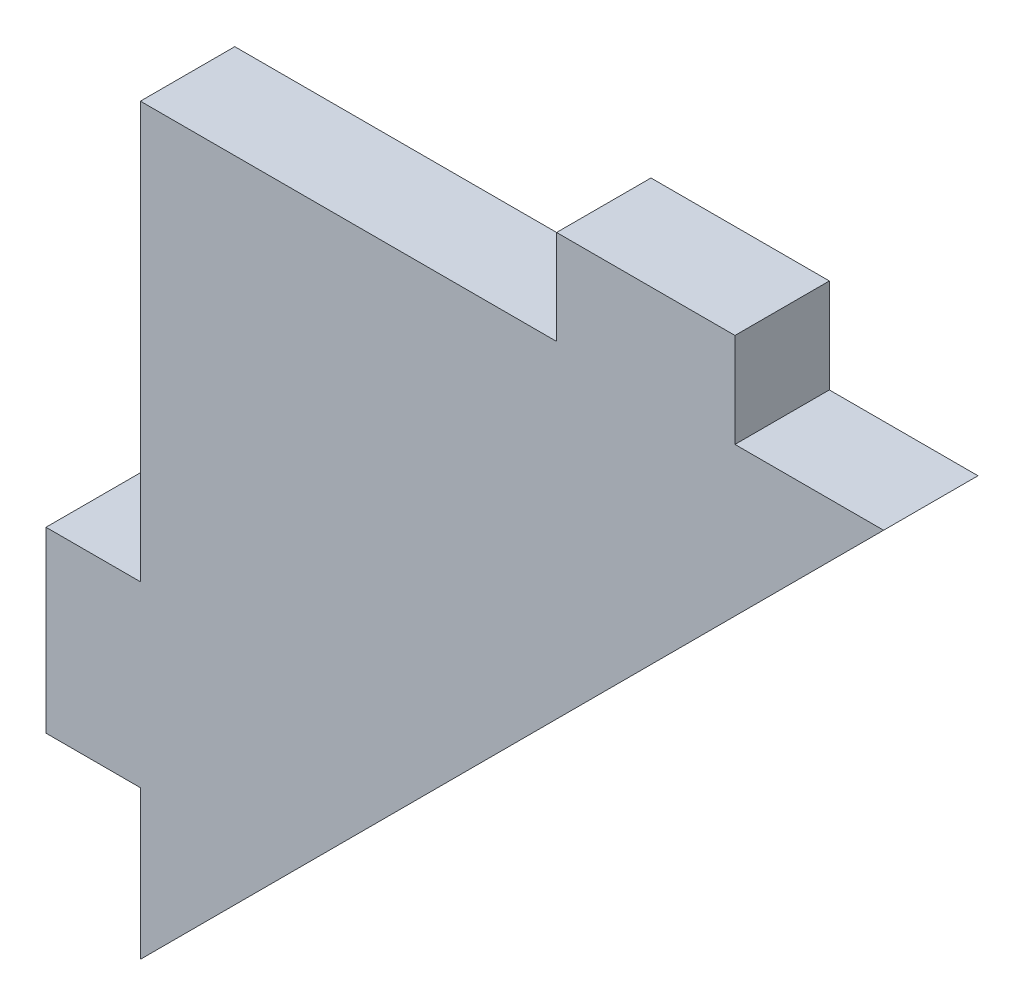
ISO-10303-21;
HEADER;
FILE_DESCRIPTION(('STEP AP214'),'2;1');
FILE_NAME('part.step','',(''),(''),'','','');
FILE_SCHEMA(('AUTOMOTIVE_DESIGN { 1 0 10303 214 1 1 1 1 }'));
ENDSEC;
DATA;
#1=APPLICATION_CONTEXT('core data for automotive mechanical design processes');
#2=APPLICATION_PROTOCOL_DEFINITION('international standard','automotive_design',2000,#1);
#3=PRODUCT_CONTEXT('',#1,'mechanical');
#4=PRODUCT('Part','Part','',(#3));
#5=PRODUCT_RELATED_PRODUCT_CATEGORY('part','',(#4));
#6=PRODUCT_DEFINITION_FORMATION('','',#4);
#7=PRODUCT_DEFINITION_CONTEXT('part definition',#1,'design');
#8=PRODUCT_DEFINITION('design','',#6,#7);
#9=PRODUCT_DEFINITION_SHAPE('','',#8);
#10=(LENGTH_UNIT() NAMED_UNIT(*) SI_UNIT(.MILLI.,.METRE.));
#11=(NAMED_UNIT(*) PLANE_ANGLE_UNIT() SI_UNIT($,.RADIAN.));
#12=(NAMED_UNIT(*) SI_UNIT($,.STERADIAN.) SOLID_ANGLE_UNIT());
#13=UNCERTAINTY_MEASURE_WITH_UNIT(LENGTH_MEASURE(1.E-05),#10,'distance_accuracy_value','');
#14=(GEOMETRIC_REPRESENTATION_CONTEXT(3) GLOBAL_UNCERTAINTY_ASSIGNED_CONTEXT((#13)) GLOBAL_UNIT_ASSIGNED_CONTEXT((#10,
#11,#12)) REPRESENTATION_CONTEXT('',''));
#15=CARTESIAN_POINT('',(0.,0.,0.));
#16=DIRECTION('',(0.,0.,1.));
#17=DIRECTION('',(1.,0.,0.));
#18=AXIS2_PLACEMENT_3D('',#15,#16,#17);
#19=CARTESIAN_POINT('',(0.,5.,1.5875));
#20=DIRECTION('',(1.,0.,0.));
#21=DIRECTION('',(0.,1.,0.));
#22=AXIS2_PLACEMENT_3D('',#19,#20,#21);
#23=PLANE('',#22);
#24=DIRECTION('',(0.,-1.,0.));
#25=VECTOR('',#24,1.);
#26=CARTESIAN_POINT('',(0.,5.,-1.5875));
#27=LINE('',#26,#25);
#28=CARTESIAN_POINT('',(0.,5.,-1.5875));
#29=VERTEX_POINT('',#28);
#30=CARTESIAN_POINT('',(0.,0.,-1.5875));
#31=VERTEX_POINT('',#30);
#32=EDGE_CURVE('E147',#29,#31,#27,.T.);
#33=ORIENTED_EDGE('',*,*,#32,.T.);
#34=DIRECTION('',(0.,0.,-1.));
#35=VECTOR('',#34,1.);
#36=CARTESIAN_POINT('',(0.,0.,1.5875));
#37=LINE('',#36,#35);
#38=CARTESIAN_POINT('',(0.,0.,1.5875));
#39=VERTEX_POINT('',#38);
#40=EDGE_CURVE('E11',#39,#31,#37,.T.);
#41=ORIENTED_EDGE('',*,*,#40,.F.);
#42=DIRECTION('',(0.,-1.,0.));
#43=VECTOR('',#42,1.);
#44=CARTESIAN_POINT('',(0.,5.,1.5875));
#45=LINE('',#44,#43);
#46=CARTESIAN_POINT('',(0.,5.,1.5875));
#47=VERTEX_POINT('',#46);
#48=EDGE_CURVE('E167',#47,#39,#45,.T.);
#49=ORIENTED_EDGE('',*,*,#48,.F.);
#50=DIRECTION('',(0.,0.,-1.));
#51=VECTOR('',#50,1.);
#52=CARTESIAN_POINT('',(0.,5.,1.5875));
#53=LINE('',#52,#51);
#54=EDGE_CURVE('E143',#47,#29,#53,.T.);
#55=ORIENTED_EDGE('',*,*,#54,.T.);
#56=EDGE_LOOP('',(#33,#41,#49,#55));
#57=FACE_BOUND('',#56,.T.);
#58=ADVANCED_FACE('F33',(#57),#23,.F.);
#59=CARTESIAN_POINT('',(25.,25.,1.5875));
#60=DIRECTION('',(-0.707106781186547,0.707106781186548,0.));
#61=DIRECTION('',(-0.707106781186548,-0.707106781186547,0.));
#62=AXIS2_PLACEMENT_3D('',#59,#60,#61);
#63=PLANE('',#62);
#64=DIRECTION('',(0.707106781186548,0.707106781186547,0.));
#65=VECTOR('',#64,1.);
#66=CARTESIAN_POINT('',(25.,25.,-1.5875));
#67=LINE('',#66,#65);
#68=CARTESIAN_POINT('',(25.,25.,-1.5875));
#69=VERTEX_POINT('',#68);
#70=EDGE_CURVE('E150',#31,#69,#67,.T.);
#71=ORIENTED_EDGE('',*,*,#70,.T.);
#72=DIRECTION('',(0.,0.,-1.));
#73=VECTOR('',#72,1.);
#74=CARTESIAN_POINT('',(25.,25.,1.5875));
#75=LINE('',#74,#73);
#76=CARTESIAN_POINT('',(25.,25.,1.5875));
#77=VERTEX_POINT('',#76);
#78=EDGE_CURVE('E41',#77,#69,#75,.T.);
#79=ORIENTED_EDGE('',*,*,#78,.F.);
#80=DIRECTION('',(0.707106781186548,0.707106781186547,0.));
#81=VECTOR('',#80,1.);
#82=CARTESIAN_POINT('',(25.,25.,1.5875));
#83=LINE('',#82,#81);
#84=EDGE_CURVE('E101',#39,#77,#83,.T.);
#85=ORIENTED_EDGE('',*,*,#84,.F.);
#86=ORIENTED_EDGE('',*,*,#40,.T.);
#87=EDGE_LOOP('',(#71,#79,#85,#86));
#88=FACE_BOUND('',#87,.T.);
#89=ADVANCED_FACE('F239',(#88),#63,.F.);
#90=CARTESIAN_POINT('',(20.,25.,1.5875));
#91=DIRECTION('',(0.,-1.,0.));
#92=DIRECTION('',(1.,0.,0.));
#93=AXIS2_PLACEMENT_3D('',#90,#91,#92);
#94=PLANE('',#93);
#95=DIRECTION('',(-1.,0.,0.));
#96=VECTOR('',#95,1.);
#97=CARTESIAN_POINT('',(20.,25.,-1.5875));
#98=LINE('',#97,#96);
#99=CARTESIAN_POINT('',(20.,25.,-1.5875));
#100=VERTEX_POINT('',#99);
#101=EDGE_CURVE('E152',#69,#100,#98,.T.);
#102=ORIENTED_EDGE('',*,*,#101,.T.);
#103=DIRECTION('',(0.,0.,-1.));
#104=VECTOR('',#103,1.);
#105=CARTESIAN_POINT('',(20.,25.,1.5875));
#106=LINE('',#105,#104);
#107=CARTESIAN_POINT('',(20.,25.,1.5875));
#108=VERTEX_POINT('',#107);
#109=EDGE_CURVE('E183',#108,#100,#106,.T.);
#110=ORIENTED_EDGE('',*,*,#109,.F.);
#111=DIRECTION('',(-1.,0.,0.));
#112=VECTOR('',#111,1.);
#113=CARTESIAN_POINT('',(20.,25.,1.5875));
#114=LINE('',#113,#112);
#115=EDGE_CURVE('E191',#77,#108,#114,.T.);
#116=ORIENTED_EDGE('',*,*,#115,.F.);
#117=ORIENTED_EDGE('',*,*,#78,.T.);
#118=EDGE_LOOP('',(#102,#110,#116,#117));
#119=FACE_BOUND('',#118,.T.);
#120=ADVANCED_FACE('F189',(#119),#94,.F.);
#121=CARTESIAN_POINT('',(20.,28.175,1.5875));
#122=DIRECTION('',(-1.,0.,0.));
#123=DIRECTION('',(0.,0.,1.));
#124=AXIS2_PLACEMENT_3D('',#121,#122,#123);
#125=PLANE('',#124);
#126=DIRECTION('',(0.,1.,0.));
#127=VECTOR('',#126,1.);
#128=CARTESIAN_POINT('',(20.,28.175,-1.5875));
#129=LINE('',#128,#127);
#130=CARTESIAN_POINT('',(20.,28.175,-1.5875));
#131=VERTEX_POINT('',#130);
#132=EDGE_CURVE('E154',#100,#131,#129,.T.);
#133=ORIENTED_EDGE('',*,*,#132,.T.);
#134=DIRECTION('',(0.,0.,-1.));
#135=VECTOR('',#134,1.);
#136=CARTESIAN_POINT('',(20.,28.175,1.5875));
#137=LINE('',#136,#135);
#138=CARTESIAN_POINT('',(20.,28.175,1.5875));
#139=VERTEX_POINT('',#138);
#140=EDGE_CURVE('E180',#139,#131,#137,.T.);
#141=ORIENTED_EDGE('',*,*,#140,.F.);
#142=DIRECTION('',(0.,1.,0.));
#143=VECTOR('',#142,1.);
#144=CARTESIAN_POINT('',(20.,28.175,1.5875));
#145=LINE('',#144,#143);
#146=EDGE_CURVE('E209',#108,#139,#145,.T.);
#147=ORIENTED_EDGE('',*,*,#146,.F.);
#148=ORIENTED_EDGE('',*,*,#109,.T.);
#149=EDGE_LOOP('',(#133,#141,#147,#148));
#150=FACE_BOUND('',#149,.T.);
#151=ADVANCED_FACE('F200',(#150),#125,.F.);
#152=CARTESIAN_POINT('',(14.,28.175,1.5875));
#153=DIRECTION('',(0.,-1.,0.));
#154=DIRECTION('',(0.,0.,-1.));
#155=AXIS2_PLACEMENT_3D('',#152,#153,#154);
#156=PLANE('',#155);
#157=DIRECTION('',(-1.,0.,0.));
#158=VECTOR('',#157,1.);
#159=CARTESIAN_POINT('',(14.,28.175,-1.5875));
#160=LINE('',#159,#158);
#161=CARTESIAN_POINT('',(14.,28.175,-1.5875));
#162=VERTEX_POINT('',#161);
#163=EDGE_CURVE('E156',#131,#162,#160,.T.);
#164=ORIENTED_EDGE('',*,*,#163,.T.);
#165=DIRECTION('',(0.,0.,-1.));
#166=VECTOR('',#165,1.);
#167=CARTESIAN_POINT('',(14.,28.175,1.5875));
#168=LINE('',#167,#166);
#169=CARTESIAN_POINT('',(14.,28.175,1.5875));
#170=VERTEX_POINT('',#169);
#171=EDGE_CURVE('E177',#170,#162,#168,.T.);
#172=ORIENTED_EDGE('',*,*,#171,.F.);
#173=DIRECTION('',(-1.,0.,0.));
#174=VECTOR('',#173,1.);
#175=CARTESIAN_POINT('',(14.,28.175,1.5875));
#176=LINE('',#175,#174);
#177=EDGE_CURVE('E206',#139,#170,#176,.T.);
#178=ORIENTED_EDGE('',*,*,#177,.F.);
#179=ORIENTED_EDGE('',*,*,#140,.T.);
#180=EDGE_LOOP('',(#164,#172,#178,#179));
#181=FACE_BOUND('',#180,.T.);
#182=ADVANCED_FACE('F204',(#181),#156,.F.);
#183=CARTESIAN_POINT('',(14.,28.175,1.5875));
#184=DIRECTION('',(1.,0.,0.));
#185=DIRECTION('',(0.,0.,-1.));
#186=AXIS2_PLACEMENT_3D('',#183,#184,#185);
#187=PLANE('',#186);
#188=DIRECTION('',(0.,-1.,0.));
#189=VECTOR('',#188,1.);
#190=CARTESIAN_POINT('',(14.,28.175,-1.5875));
#191=LINE('',#190,#189);
#192=CARTESIAN_POINT('',(14.,25.,-1.5875));
#193=VERTEX_POINT('',#192);
#194=EDGE_CURVE('E158',#162,#193,#191,.T.);
#195=ORIENTED_EDGE('',*,*,#194,.T.);
#196=DIRECTION('',(0.,0.,-1.));
#197=VECTOR('',#196,1.);
#198=CARTESIAN_POINT('',(14.,25.,1.5875));
#199=LINE('',#198,#197);
#200=CARTESIAN_POINT('',(14.,25.,1.5875));
#201=VERTEX_POINT('',#200);
#202=EDGE_CURVE('E174',#201,#193,#199,.T.);
#203=ORIENTED_EDGE('',*,*,#202,.F.);
#204=DIRECTION('',(0.,-1.,0.));
#205=VECTOR('',#204,1.);
#206=CARTESIAN_POINT('',(14.,28.175,1.5875));
#207=LINE('',#206,#205);
#208=EDGE_CURVE('E208',#170,#201,#207,.T.);
#209=ORIENTED_EDGE('',*,*,#208,.F.);
#210=ORIENTED_EDGE('',*,*,#171,.T.);
#211=EDGE_LOOP('',(#195,#203,#209,#210));
#212=FACE_BOUND('',#211,.T.);
#213=ADVANCED_FACE('F252',(#212),#187,.F.);
#214=CARTESIAN_POINT('',(0.,25.,1.5875));
#215=DIRECTION('',(0.,-1.,0.));
#216=DIRECTION('',(0.,0.,-1.));
#217=AXIS2_PLACEMENT_3D('',#214,#215,#216);
#218=PLANE('',#217);
#219=DIRECTION('',(-1.,0.,0.));
#220=VECTOR('',#219,1.);
#221=CARTESIAN_POINT('',(0.,25.,-1.5875));
#222=LINE('',#221,#220);
#223=CARTESIAN_POINT('',(0.,25.,-1.5875));
#224=VERTEX_POINT('',#223);
#225=EDGE_CURVE('E160',#193,#224,#222,.T.);
#226=ORIENTED_EDGE('',*,*,#225,.T.);
#227=DIRECTION('',(0.,0.,-1.));
#228=VECTOR('',#227,1.);
#229=CARTESIAN_POINT('',(0.,25.,1.5875));
#230=LINE('',#229,#228);
#231=CARTESIAN_POINT('',(0.,25.,1.5875));
#232=VERTEX_POINT('',#231);
#233=EDGE_CURVE('E171',#232,#224,#230,.T.);
#234=ORIENTED_EDGE('',*,*,#233,.F.);
#235=DIRECTION('',(-1.,0.,0.));
#236=VECTOR('',#235,1.);
#237=CARTESIAN_POINT('',(0.,25.,1.5875));
#238=LINE('',#237,#236);
#239=EDGE_CURVE('E211',#201,#232,#238,.T.);
#240=ORIENTED_EDGE('',*,*,#239,.F.);
#241=ORIENTED_EDGE('',*,*,#202,.T.);
#242=EDGE_LOOP('',(#226,#234,#240,#241));
#243=FACE_BOUND('',#242,.T.);
#244=ADVANCED_FACE('F220',(#243),#218,.F.);
#245=CARTESIAN_POINT('',(0.,25.,1.5875));
#246=DIRECTION('',(1.,0.,0.));
#247=DIRECTION('',(0.,1.,0.));
#248=AXIS2_PLACEMENT_3D('',#245,#246,#247);
#249=PLANE('',#248);
#250=DIRECTION('',(0.,-1.,0.));
#251=VECTOR('',#250,1.);
#252=CARTESIAN_POINT('',(0.,25.,-1.5875));
#253=LINE('',#252,#251);
#254=CARTESIAN_POINT('',(0.,11.,-1.5875));
#255=VERTEX_POINT('',#254);
#256=EDGE_CURVE('E162',#224,#255,#253,.T.);
#257=ORIENTED_EDGE('',*,*,#256,.T.);
#258=DIRECTION('',(0.,0.,-1.));
#259=VECTOR('',#258,1.);
#260=CARTESIAN_POINT('',(0.,11.,1.5875));
#261=LINE('',#260,#259);
#262=CARTESIAN_POINT('',(0.,11.,1.5875));
#263=VERTEX_POINT('',#262);
#264=EDGE_CURVE('E138',#263,#255,#261,.T.);
#265=ORIENTED_EDGE('',*,*,#264,.F.);
#266=DIRECTION('',(0.,-1.,0.));
#267=VECTOR('',#266,1.);
#268=CARTESIAN_POINT('',(0.,25.,1.5875));
#269=LINE('',#268,#267);
#270=EDGE_CURVE('E129',#232,#263,#269,.T.);
#271=ORIENTED_EDGE('',*,*,#270,.F.);
#272=ORIENTED_EDGE('',*,*,#233,.T.);
#273=EDGE_LOOP('',(#257,#265,#271,#272));
#274=FACE_BOUND('',#273,.T.);
#275=ADVANCED_FACE('F224',(#274),#249,.F.);
#276=CARTESIAN_POINT('',(0.,11.,1.5875));
#277=DIRECTION('',(0.,-1.,0.));
#278=DIRECTION('',(0.,0.,-1.));
#279=AXIS2_PLACEMENT_3D('',#276,#277,#278);
#280=PLANE('',#279);
#281=DIRECTION('',(-1.,0.,0.));
#282=VECTOR('',#281,1.);
#283=CARTESIAN_POINT('',(0.,11.,-1.5875));
#284=LINE('',#283,#282);
#285=CARTESIAN_POINT('',(-3.175,11.,-1.5875));
#286=VERTEX_POINT('',#285);
#287=EDGE_CURVE('E137',#255,#286,#284,.T.);
#288=ORIENTED_EDGE('',*,*,#287,.T.);
#289=DIRECTION('',(0.,0.,-1.));
#290=VECTOR('',#289,1.);
#291=CARTESIAN_POINT('',(-3.175,11.,1.5875));
#292=LINE('',#291,#290);
#293=CARTESIAN_POINT('',(-3.175,11.,1.5875));
#294=VERTEX_POINT('',#293);
#295=EDGE_CURVE('E134',#294,#286,#292,.T.);
#296=ORIENTED_EDGE('',*,*,#295,.F.);
#297=DIRECTION('',(-1.,0.,0.));
#298=VECTOR('',#297,1.);
#299=CARTESIAN_POINT('',(0.,11.,1.5875));
#300=LINE('',#299,#298);
#301=EDGE_CURVE('E123',#263,#294,#300,.T.);
#302=ORIENTED_EDGE('',*,*,#301,.F.);
#303=ORIENTED_EDGE('',*,*,#264,.T.);
#304=EDGE_LOOP('',(#288,#296,#302,#303));
#305=FACE_BOUND('',#304,.T.);
#306=ADVANCED_FACE('F135',(#305),#280,.F.);
#307=CARTESIAN_POINT('',(-3.175,11.,1.5875));
#308=DIRECTION('',(1.,0.,0.));
#309=DIRECTION('',(0.,1.,0.));
#310=AXIS2_PLACEMENT_3D('',#307,#308,#309);
#311=PLANE('',#310);
#312=DIRECTION('',(0.,-1.,0.));
#313=VECTOR('',#312,1.);
#314=CARTESIAN_POINT('',(-3.175,11.,-1.5875));
#315=LINE('',#314,#313);
#316=CARTESIAN_POINT('',(-3.175,5.,-1.5875));
#317=VERTEX_POINT('',#316);
#318=EDGE_CURVE('E87',#286,#317,#315,.T.);
#319=ORIENTED_EDGE('',*,*,#318,.T.);
#320=DIRECTION('',(0.,0.,-1.));
#321=VECTOR('',#320,1.);
#322=CARTESIAN_POINT('',(-3.175,5.,1.5875));
#323=LINE('',#322,#321);
#324=CARTESIAN_POINT('',(-3.175,5.,1.5875));
#325=VERTEX_POINT('',#324);
#326=EDGE_CURVE('E139',#325,#317,#323,.T.);
#327=ORIENTED_EDGE('',*,*,#326,.F.);
#328=DIRECTION('',(0.,-1.,0.));
#329=VECTOR('',#328,1.);
#330=CARTESIAN_POINT('',(-3.175,11.,1.5875));
#331=LINE('',#330,#329);
#332=EDGE_CURVE('E127',#294,#325,#331,.T.);
#333=ORIENTED_EDGE('',*,*,#332,.F.);
#334=ORIENTED_EDGE('',*,*,#295,.T.);
#335=EDGE_LOOP('',(#319,#327,#333,#334));
#336=FACE_BOUND('',#335,.T.);
#337=ADVANCED_FACE('F141',(#336),#311,.F.);
#338=CARTESIAN_POINT('',(-3.175,5.,1.5875));
#339=DIRECTION('',(0.,1.,0.));
#340=DIRECTION('',(-1.,0.,0.));
#341=AXIS2_PLACEMENT_3D('',#338,#339,#340);
#342=PLANE('',#341);
#343=DIRECTION('',(1.,0.,0.));
#344=VECTOR('',#343,1.);
#345=CARTESIAN_POINT('',(-3.175,5.,-1.5875));
#346=LINE('',#345,#344);
#347=EDGE_CURVE('E93',#317,#29,#346,.T.);
#348=ORIENTED_EDGE('',*,*,#347,.T.);
#349=ORIENTED_EDGE('',*,*,#54,.F.);
#350=DIRECTION('',(1.,0.,0.));
#351=VECTOR('',#350,1.);
#352=CARTESIAN_POINT('',(-3.175,5.,1.5875));
#353=LINE('',#352,#351);
#354=EDGE_CURVE('E49',#325,#47,#353,.T.);
#355=ORIENTED_EDGE('',*,*,#354,.F.);
#356=ORIENTED_EDGE('',*,*,#326,.T.);
#357=EDGE_LOOP('',(#348,#349,#355,#356));
#358=FACE_BOUND('',#357,.T.);
#359=ADVANCED_FACE('F228',(#358),#342,.F.);
#360=CARTESIAN_POINT('',(0.,0.,1.5875));
#361=DIRECTION('',(0.,0.,1.));
#362=DIRECTION('',(1.,0.,0.));
#363=AXIS2_PLACEMENT_3D('',#360,#361,#362);
#364=PLANE('',#363);
#365=ORIENTED_EDGE('',*,*,#48,.T.);
#366=ORIENTED_EDGE('',*,*,#84,.T.);
#367=ORIENTED_EDGE('',*,*,#115,.T.);
#368=ORIENTED_EDGE('',*,*,#146,.T.);
#369=ORIENTED_EDGE('',*,*,#177,.T.);
#370=ORIENTED_EDGE('',*,*,#208,.T.);
#371=ORIENTED_EDGE('',*,*,#239,.T.);
#372=ORIENTED_EDGE('',*,*,#270,.T.);
#373=ORIENTED_EDGE('',*,*,#301,.T.);
#374=ORIENTED_EDGE('',*,*,#332,.T.);
#375=ORIENTED_EDGE('',*,*,#354,.T.);
#376=EDGE_LOOP('',(#365,#366,#367,#368,#369,#370,#371,#372,#373,#374,#375));
#377=FACE_BOUND('',#376,.T.);
#378=ADVANCED_FACE('F125',(#377),#364,.T.);
#379=CARTESIAN_POINT('',(0.,0.,-1.5875));
#380=DIRECTION('',(0.,0.,1.));
#381=DIRECTION('',(1.,0.,0.));
#382=AXIS2_PLACEMENT_3D('',#379,#380,#381);
#383=PLANE('',#382);
#384=ORIENTED_EDGE('',*,*,#32,.F.);
#385=ORIENTED_EDGE('',*,*,#347,.F.);
#386=ORIENTED_EDGE('',*,*,#318,.F.);
#387=ORIENTED_EDGE('',*,*,#287,.F.);
#388=ORIENTED_EDGE('',*,*,#256,.F.);
#389=ORIENTED_EDGE('',*,*,#225,.F.);
#390=ORIENTED_EDGE('',*,*,#194,.F.);
#391=ORIENTED_EDGE('',*,*,#163,.F.);
#392=ORIENTED_EDGE('',*,*,#132,.F.);
#393=ORIENTED_EDGE('',*,*,#101,.F.);
#394=ORIENTED_EDGE('',*,*,#70,.F.);
#395=EDGE_LOOP('',(#384,#385,#386,#387,#388,#389,#390,#391,#392,#393,#394));
#396=FACE_BOUND('',#395,.T.);
#397=ADVANCED_FACE('F195',(#396),#383,.F.);
#398=CLOSED_SHELL('',(#58,#89,#120,#151,#182,#213,#244,#275,#306,#337,#359,#378,#397));
#399=MANIFOLD_SOLID_BREP('B2',#398);
#400=ADVANCED_BREP_SHAPE_REPRESENTATION('',(#18,#399),#14);
#401=SHAPE_DEFINITION_REPRESENTATION(#9,#400);
ENDSEC;
END-ISO-10303-21;
